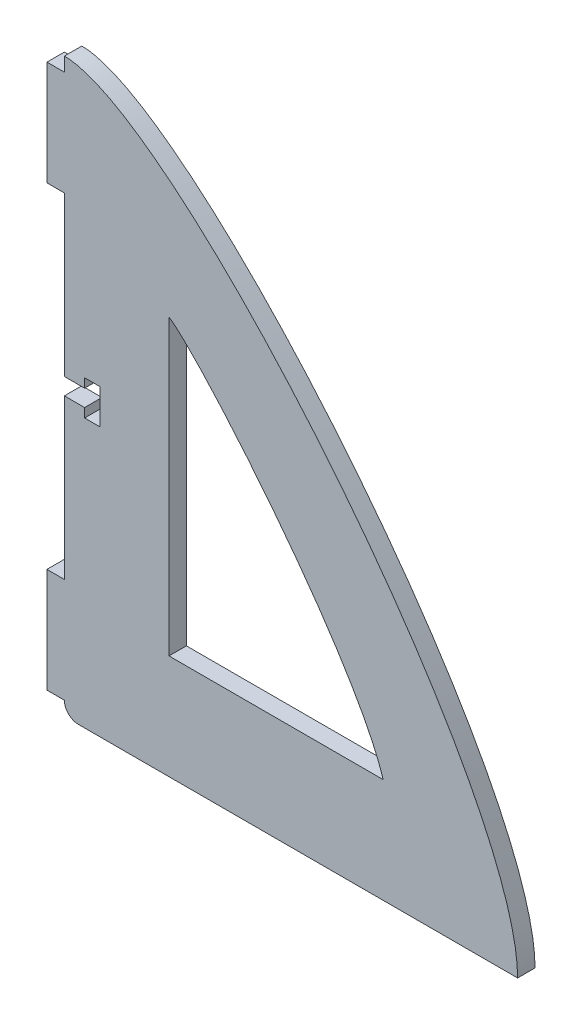
ISO-10303-21;
HEADER;
FILE_DESCRIPTION(('STEP AP214'),'2;1');
FILE_NAME('part.step','',(''),(''),'','','');
FILE_SCHEMA(('AUTOMOTIVE_DESIGN { 1 0 10303 214 1 1 1 1 }'));
ENDSEC;
DATA;
#1=APPLICATION_CONTEXT('core data for automotive mechanical design processes');
#2=APPLICATION_PROTOCOL_DEFINITION('international standard','automotive_design',2000,#1);
#3=PRODUCT_CONTEXT('',#1,'mechanical');
#4=PRODUCT('Part','Part','',(#3));
#5=PRODUCT_RELATED_PRODUCT_CATEGORY('part','',(#4));
#6=PRODUCT_DEFINITION_FORMATION('','',#4);
#7=PRODUCT_DEFINITION_CONTEXT('part definition',#1,'design');
#8=PRODUCT_DEFINITION('design','',#6,#7);
#9=PRODUCT_DEFINITION_SHAPE('','',#8);
#10=(LENGTH_UNIT() NAMED_UNIT(*) SI_UNIT(.MILLI.,.METRE.));
#11=(NAMED_UNIT(*) PLANE_ANGLE_UNIT() SI_UNIT($,.RADIAN.));
#12=(NAMED_UNIT(*) SI_UNIT($,.STERADIAN.) SOLID_ANGLE_UNIT());
#13=UNCERTAINTY_MEASURE_WITH_UNIT(LENGTH_MEASURE(1.E-05),#10,'distance_accuracy_value','');
#14=(GEOMETRIC_REPRESENTATION_CONTEXT(3) GLOBAL_UNCERTAINTY_ASSIGNED_CONTEXT((#13)) GLOBAL_UNIT_ASSIGNED_CONTEXT((#10,
#11,#12)) REPRESENTATION_CONTEXT('',''));
#15=CARTESIAN_POINT('',(0.,0.,0.));
#16=DIRECTION('',(0.,0.,1.));
#17=DIRECTION('',(1.,0.,0.));
#18=AXIS2_PLACEMENT_3D('',#15,#16,#17);
#19=CARTESIAN_POINT('',(49.08086934543,63.1550222466123,3.175));
#20=DIRECTION('',(0.,0.,1.));
#21=DIRECTION('',(1.,0.,0.));
#22=AXIS2_PLACEMENT_3D('',#19,#20,#21);
#23=PLANE('',#22);
#24=CARTESIAN_POINT('',(82.55,0.,3.175));
#25=CARTESIAN_POINT('',(82.55,29.5600593242995,3.175));
#26=CARTESIAN_POINT('',(20.8156515878134,104.14,3.175));
#27=CARTESIAN_POINT('',(0.,104.14,3.175));
#28=B_SPLINE_CURVE_WITH_KNOTS('',3,(#24,#25,#26,#27),.UNSPECIFIED.,.F.,.F.,(4,4),(0.,1.),.UNSPECIFIED.);
#29=CARTESIAN_POINT('',(82.55,0.,3.175));
#30=VERTEX_POINT('',#29);
#31=CARTESIAN_POINT('',(0.,104.14,3.175));
#32=VERTEX_POINT('',#31);
#33=EDGE_CURVE('E219',#30,#32,#28,.T.);
#34=ORIENTED_EDGE('',*,*,#33,.T.);
#35=DIRECTION('',(0.,-1.,0.));
#36=VECTOR('',#35,1.);
#37=CARTESIAN_POINT('',(0.,101.6,3.175));
#38=LINE('',#37,#36);
#39=CARTESIAN_POINT('',(0.,101.6,3.175));
#40=VERTEX_POINT('',#39);
#41=EDGE_CURVE('E225',#32,#40,#38,.T.);
#42=ORIENTED_EDGE('',*,*,#41,.T.);
#43=DIRECTION('',(-1.,0.,0.));
#44=VECTOR('',#43,1.);
#45=CARTESIAN_POINT('',(0.,101.6,3.175));
#46=LINE('',#45,#44);
#47=CARTESIAN_POINT('',(-3.17499999999999,101.6,3.175));
#48=VERTEX_POINT('',#47);
#49=EDGE_CURVE('E231',#40,#48,#46,.T.);
#50=ORIENTED_EDGE('',*,*,#49,.T.);
#51=DIRECTION('',(0.,-1.,0.));
#52=VECTOR('',#51,1.);
#53=CARTESIAN_POINT('',(-3.17499999999999,101.6,3.175));
#54=LINE('',#53,#52);
#55=CARTESIAN_POINT('',(-3.17499999999999,82.55,3.175));
#56=VERTEX_POINT('',#55);
#57=EDGE_CURVE('E233',#48,#56,#54,.T.);
#58=ORIENTED_EDGE('',*,*,#57,.T.);
#59=DIRECTION('',(1.,0.,0.));
#60=VECTOR('',#59,1.);
#61=CARTESIAN_POINT('',(-3.17499999999999,82.55,3.175));
#62=LINE('',#61,#60);
#63=CARTESIAN_POINT('',(0.,82.55,3.175));
#64=VERTEX_POINT('',#63);
#65=EDGE_CURVE('E235',#56,#64,#62,.T.);
#66=ORIENTED_EDGE('',*,*,#65,.T.);
#67=DIRECTION('',(0.,-1.,0.));
#68=VECTOR('',#67,1.);
#69=CARTESIAN_POINT('',(0.,82.55,3.175));
#70=LINE('',#69,#68);
#71=CARTESIAN_POINT('',(0.,53.594,3.175));
#72=VERTEX_POINT('',#71);
#73=EDGE_CURVE('E237',#64,#72,#70,.T.);
#74=ORIENTED_EDGE('',*,*,#73,.T.);
#75=DIRECTION('',(1.,0.,0.));
#76=VECTOR('',#75,1.);
#77=CARTESIAN_POINT('',(0.,53.594,3.175));
#78=LINE('',#77,#76);
#79=CARTESIAN_POINT('',(3.68300000000001,53.594,3.175));
#80=VERTEX_POINT('',#79);
#81=EDGE_CURVE('E239',#72,#80,#78,.T.);
#82=ORIENTED_EDGE('',*,*,#81,.T.);
#83=DIRECTION('',(0.,1.,0.));
#84=VECTOR('',#83,1.);
#85=CARTESIAN_POINT('',(3.68300000000001,53.594,3.175));
#86=LINE('',#85,#84);
#87=CARTESIAN_POINT('',(3.68300000000001,55.245,3.175));
#88=VERTEX_POINT('',#87);
#89=EDGE_CURVE('E241',#80,#88,#86,.T.);
#90=ORIENTED_EDGE('',*,*,#89,.T.);
#91=DIRECTION('',(1.,0.,0.));
#92=VECTOR('',#91,1.);
#93=CARTESIAN_POINT('',(3.68300000000001,55.245,3.175));
#94=LINE('',#93,#92);
#95=CARTESIAN_POINT('',(6.47700000000001,55.245,3.175));
#96=VERTEX_POINT('',#95);
#97=EDGE_CURVE('E243',#88,#96,#94,.T.);
#98=ORIENTED_EDGE('',*,*,#97,.T.);
#99=DIRECTION('',(0.,-1.,0.));
#100=VECTOR('',#99,1.);
#101=CARTESIAN_POINT('',(6.47700000000001,55.245,3.175));
#102=LINE('',#101,#100);
#103=CARTESIAN_POINT('',(6.47700000000001,48.895,3.175));
#104=VERTEX_POINT('',#103);
#105=EDGE_CURVE('E245',#96,#104,#102,.T.);
#106=ORIENTED_EDGE('',*,*,#105,.T.);
#107=DIRECTION('',(-1.,0.,0.));
#108=VECTOR('',#107,1.);
#109=CARTESIAN_POINT('',(6.47700000000001,48.895,3.175));
#110=LINE('',#109,#108);
#111=CARTESIAN_POINT('',(3.68300000000001,48.895,3.175));
#112=VERTEX_POINT('',#111);
#113=EDGE_CURVE('E247',#104,#112,#110,.T.);
#114=ORIENTED_EDGE('',*,*,#113,.T.);
#115=DIRECTION('',(0.,1.,0.));
#116=VECTOR('',#115,1.);
#117=CARTESIAN_POINT('',(3.68300000000001,48.895,3.175));
#118=LINE('',#117,#116);
#119=CARTESIAN_POINT('',(3.68300000000001,50.546,3.175));
#120=VERTEX_POINT('',#119);
#121=EDGE_CURVE('E249',#112,#120,#118,.T.);
#122=ORIENTED_EDGE('',*,*,#121,.T.);
#123=DIRECTION('',(-1.,0.,0.));
#124=VECTOR('',#123,1.);
#125=CARTESIAN_POINT('',(3.68300000000001,50.546,3.175));
#126=LINE('',#125,#124);
#127=CARTESIAN_POINT('',(0.,50.546,3.175));
#128=VERTEX_POINT('',#127);
#129=EDGE_CURVE('E251',#120,#128,#126,.T.);
#130=ORIENTED_EDGE('',*,*,#129,.T.);
#131=DIRECTION('',(0.,-1.,0.));
#132=VECTOR('',#131,1.);
#133=CARTESIAN_POINT('',(0.,50.546,3.175));
#134=LINE('',#133,#132);
#135=CARTESIAN_POINT('',(0.,21.59,3.175));
#136=VERTEX_POINT('',#135);
#137=EDGE_CURVE('E253',#128,#136,#134,.T.);
#138=ORIENTED_EDGE('',*,*,#137,.T.);
#139=DIRECTION('',(-1.,0.,0.));
#140=VECTOR('',#139,1.);
#141=CARTESIAN_POINT('',(-3.175,21.59,3.175));
#142=LINE('',#141,#140);
#143=CARTESIAN_POINT('',(-3.175,21.59,3.175));
#144=VERTEX_POINT('',#143);
#145=EDGE_CURVE('E255',#136,#144,#142,.T.);
#146=ORIENTED_EDGE('',*,*,#145,.T.);
#147=DIRECTION('',(0.,-1.,0.));
#148=VECTOR('',#147,1.);
#149=CARTESIAN_POINT('',(-3.175,2.54,3.175));
#150=LINE('',#149,#148);
#151=CARTESIAN_POINT('',(-3.175,2.54,3.175));
#152=VERTEX_POINT('',#151);
#153=EDGE_CURVE('E257',#144,#152,#150,.T.);
#154=ORIENTED_EDGE('',*,*,#153,.T.);
#155=DIRECTION('',(1.,0.,0.));
#156=VECTOR('',#155,1.);
#157=CARTESIAN_POINT('',(0.,2.54,3.175));
#158=LINE('',#157,#156);
#159=CARTESIAN_POINT('',(0.,2.54,3.175));
#160=VERTEX_POINT('',#159);
#161=EDGE_CURVE('E259',#152,#160,#158,.T.);
#162=ORIENTED_EDGE('',*,*,#161,.T.);
#163=CARTESIAN_POINT('',(2.54000000000001,2.54,3.175));
#164=DIRECTION('',(0.,0.,1.));
#165=DIRECTION('',(1.,0.,0.));
#166=AXIS2_PLACEMENT_3D('',#163,#164,#165);
#167=CIRCLE('',#166,2.54);
#168=CARTESIAN_POINT('',(2.54000000000001,0.,3.175));
#169=VERTEX_POINT('',#168);
#170=EDGE_CURVE('E261',#160,#169,#167,.T.);
#171=ORIENTED_EDGE('',*,*,#170,.T.);
#172=DIRECTION('',(1.,0.,0.));
#173=VECTOR('',#172,1.);
#174=CARTESIAN_POINT('',(2.54000000000001,0.,3.175));
#175=LINE('',#174,#173);
#176=EDGE_CURVE('E263',#169,#30,#175,.T.);
#177=ORIENTED_EDGE('',*,*,#176,.T.);
#178=EDGE_LOOP('',(#34,#42,#50,#58,#66,#74,#82,#90,#98,#106,#114,#122,#130,#138,#146,#154,#162,
#171,#177));
#179=FACE_BOUND('',#178,.T.);
#180=DIRECTION('',(0.,-1.,0.));
#181=VECTOR('',#180,1.);
#182=CARTESIAN_POINT('',(19.05,72.5277006282425,3.175));
#183=LINE('',#182,#181);
#184=CARTESIAN_POINT('',(19.05,72.5277006282425,3.175));
#185=VERTEX_POINT('',#184);
#186=CARTESIAN_POINT('',(19.05,19.05,3.175));
#187=VERTEX_POINT('',#186);
#188=EDGE_CURVE('E193',#185,#187,#183,.T.);
#189=ORIENTED_EDGE('',*,*,#188,.F.);
#190=CARTESIAN_POINT('',(58.0732755997919,19.05,3.175));
#191=CARTESIAN_POINT('',(52.9819705020623,35.4593054658,3.175));
#192=CARTESIAN_POINT('',(24.9796059291707,68.6375608936451,3.175));
#193=CARTESIAN_POINT('',(19.05,72.5277006282425,3.175));
#194=B_SPLINE_CURVE_WITH_KNOTS('',3,(#190,#191,#192,#193),.UNSPECIFIED.,.F.,.F.,(4,4),(0.,1.),.UNSPECIFIED.);
#195=CARTESIAN_POINT('',(58.0732755997919,19.05,3.175));
#196=VERTEX_POINT('',#195);
#197=EDGE_CURVE('E185',#196,#185,#194,.T.);
#198=ORIENTED_EDGE('',*,*,#197,.F.);
#199=DIRECTION('',(1.,0.,0.));
#200=VECTOR('',#199,1.);
#201=CARTESIAN_POINT('',(19.05,19.05,3.175));
#202=LINE('',#201,#200);
#203=EDGE_CURVE('E202',#187,#196,#202,.T.);
#204=ORIENTED_EDGE('',*,*,#203,.F.);
#205=EDGE_LOOP('',(#189,#198,#204));
#206=FACE_BOUND('',#205,.T.);
#207=ADVANCED_FACE('F35',(#179,#206),#23,.T.);
#208=CARTESIAN_POINT('',(49.08086934543,63.1550222466123,0.));
#209=DIRECTION('',(0.,0.,1.));
#210=DIRECTION('',(1.,0.,0.));
#211=AXIS2_PLACEMENT_3D('',#208,#209,#210);
#212=PLANE('',#211);
#213=CARTESIAN_POINT('',(82.55,0.,0.));
#214=CARTESIAN_POINT('',(82.55,29.5600593242995,0.));
#215=CARTESIAN_POINT('',(20.8156515878134,104.14,0.));
#216=CARTESIAN_POINT('',(0.,104.14,0.));
#217=B_SPLINE_CURVE_WITH_KNOTS('',3,(#213,#214,#215,#216),.UNSPECIFIED.,.F.,.F.,(4,4),(0.,1.),.UNSPECIFIED.);
#218=CARTESIAN_POINT('',(82.55,0.,0.));
#219=VERTEX_POINT('',#218);
#220=CARTESIAN_POINT('',(0.,104.14,0.));
#221=VERTEX_POINT('',#220);
#222=EDGE_CURVE('E200',#219,#221,#217,.T.);
#223=ORIENTED_EDGE('',*,*,#222,.F.);
#224=DIRECTION('',(1.,0.,0.));
#225=VECTOR('',#224,1.);
#226=CARTESIAN_POINT('',(2.54000000000001,0.,0.));
#227=LINE('',#226,#225);
#228=CARTESIAN_POINT('',(2.54000000000001,0.,0.));
#229=VERTEX_POINT('',#228);
#230=EDGE_CURVE('E226',#229,#219,#227,.T.);
#231=ORIENTED_EDGE('',*,*,#230,.F.);
#232=CARTESIAN_POINT('',(2.54000000000001,2.54,0.));
#233=DIRECTION('',(0.,0.,1.));
#234=DIRECTION('',(1.,0.,0.));
#235=AXIS2_PLACEMENT_3D('',#232,#233,#234);
#236=CIRCLE('',#235,2.54);
#237=CARTESIAN_POINT('',(0.,2.54,0.));
#238=VERTEX_POINT('',#237);
#239=EDGE_CURVE('E305',#238,#229,#236,.T.);
#240=ORIENTED_EDGE('',*,*,#239,.F.);
#241=DIRECTION('',(1.,0.,0.));
#242=VECTOR('',#241,1.);
#243=CARTESIAN_POINT('',(0.,2.54,0.));
#244=LINE('',#243,#242);
#245=CARTESIAN_POINT('',(-3.175,2.54,0.));
#246=VERTEX_POINT('',#245);
#247=EDGE_CURVE('E303',#246,#238,#244,.T.);
#248=ORIENTED_EDGE('',*,*,#247,.F.);
#249=DIRECTION('',(0.,-1.,0.));
#250=VECTOR('',#249,1.);
#251=CARTESIAN_POINT('',(-3.175,2.54,0.));
#252=LINE('',#251,#250);
#253=CARTESIAN_POINT('',(-3.175,21.59,0.));
#254=VERTEX_POINT('',#253);
#255=EDGE_CURVE('E301',#254,#246,#252,.T.);
#256=ORIENTED_EDGE('',*,*,#255,.F.);
#257=DIRECTION('',(-1.,0.,0.));
#258=VECTOR('',#257,1.);
#259=CARTESIAN_POINT('',(-3.175,21.59,0.));
#260=LINE('',#259,#258);
#261=CARTESIAN_POINT('',(0.,21.59,0.));
#262=VERTEX_POINT('',#261);
#263=EDGE_CURVE('E299',#262,#254,#260,.T.);
#264=ORIENTED_EDGE('',*,*,#263,.F.);
#265=DIRECTION('',(0.,-1.,0.));
#266=VECTOR('',#265,1.);
#267=CARTESIAN_POINT('',(0.,50.546,0.));
#268=LINE('',#267,#266);
#269=CARTESIAN_POINT('',(0.,50.546,0.));
#270=VERTEX_POINT('',#269);
#271=EDGE_CURVE('E297',#270,#262,#268,.T.);
#272=ORIENTED_EDGE('',*,*,#271,.F.);
#273=DIRECTION('',(-1.,0.,0.));
#274=VECTOR('',#273,1.);
#275=CARTESIAN_POINT('',(3.68300000000001,50.546,0.));
#276=LINE('',#275,#274);
#277=CARTESIAN_POINT('',(3.68300000000001,50.546,0.));
#278=VERTEX_POINT('',#277);
#279=EDGE_CURVE('E295',#278,#270,#276,.T.);
#280=ORIENTED_EDGE('',*,*,#279,.F.);
#281=DIRECTION('',(0.,1.,0.));
#282=VECTOR('',#281,1.);
#283=CARTESIAN_POINT('',(3.68300000000001,48.895,0.));
#284=LINE('',#283,#282);
#285=CARTESIAN_POINT('',(3.68300000000001,48.895,0.));
#286=VERTEX_POINT('',#285);
#287=EDGE_CURVE('E293',#286,#278,#284,.T.);
#288=ORIENTED_EDGE('',*,*,#287,.F.);
#289=DIRECTION('',(-1.,0.,0.));
#290=VECTOR('',#289,1.);
#291=CARTESIAN_POINT('',(6.47700000000001,48.895,0.));
#292=LINE('',#291,#290);
#293=CARTESIAN_POINT('',(6.47700000000001,48.895,0.));
#294=VERTEX_POINT('',#293);
#295=EDGE_CURVE('E291',#294,#286,#292,.T.);
#296=ORIENTED_EDGE('',*,*,#295,.F.);
#297=DIRECTION('',(0.,-1.,0.));
#298=VECTOR('',#297,1.);
#299=CARTESIAN_POINT('',(6.47700000000001,55.245,0.));
#300=LINE('',#299,#298);
#301=CARTESIAN_POINT('',(6.47700000000001,55.245,0.));
#302=VERTEX_POINT('',#301);
#303=EDGE_CURVE('E289',#302,#294,#300,.T.);
#304=ORIENTED_EDGE('',*,*,#303,.F.);
#305=DIRECTION('',(1.,0.,0.));
#306=VECTOR('',#305,1.);
#307=CARTESIAN_POINT('',(3.68300000000001,55.245,0.));
#308=LINE('',#307,#306);
#309=CARTESIAN_POINT('',(3.68300000000001,55.245,0.));
#310=VERTEX_POINT('',#309);
#311=EDGE_CURVE('E287',#310,#302,#308,.T.);
#312=ORIENTED_EDGE('',*,*,#311,.F.);
#313=DIRECTION('',(0.,1.,0.));
#314=VECTOR('',#313,1.);
#315=CARTESIAN_POINT('',(3.68300000000001,53.594,0.));
#316=LINE('',#315,#314);
#317=CARTESIAN_POINT('',(3.68300000000001,53.594,0.));
#318=VERTEX_POINT('',#317);
#319=EDGE_CURVE('E285',#318,#310,#316,.T.);
#320=ORIENTED_EDGE('',*,*,#319,.F.);
#321=DIRECTION('',(1.,0.,0.));
#322=VECTOR('',#321,1.);
#323=CARTESIAN_POINT('',(0.,53.594,0.));
#324=LINE('',#323,#322);
#325=CARTESIAN_POINT('',(0.,53.594,0.));
#326=VERTEX_POINT('',#325);
#327=EDGE_CURVE('E283',#326,#318,#324,.T.);
#328=ORIENTED_EDGE('',*,*,#327,.F.);
#329=DIRECTION('',(0.,-1.,0.));
#330=VECTOR('',#329,1.);
#331=CARTESIAN_POINT('',(0.,82.55,0.));
#332=LINE('',#331,#330);
#333=CARTESIAN_POINT('',(0.,82.55,0.));
#334=VERTEX_POINT('',#333);
#335=EDGE_CURVE('E281',#334,#326,#332,.T.);
#336=ORIENTED_EDGE('',*,*,#335,.F.);
#337=DIRECTION('',(1.,0.,0.));
#338=VECTOR('',#337,1.);
#339=CARTESIAN_POINT('',(-3.17499999999999,82.55,0.));
#340=LINE('',#339,#338);
#341=CARTESIAN_POINT('',(-3.17499999999999,82.55,0.));
#342=VERTEX_POINT('',#341);
#343=EDGE_CURVE('E279',#342,#334,#340,.T.);
#344=ORIENTED_EDGE('',*,*,#343,.F.);
#345=DIRECTION('',(0.,-1.,0.));
#346=VECTOR('',#345,1.);
#347=CARTESIAN_POINT('',(-3.17499999999999,101.6,0.));
#348=LINE('',#347,#346);
#349=CARTESIAN_POINT('',(-3.17499999999999,101.6,0.));
#350=VERTEX_POINT('',#349);
#351=EDGE_CURVE('E277',#350,#342,#348,.T.);
#352=ORIENTED_EDGE('',*,*,#351,.F.);
#353=DIRECTION('',(-1.,0.,0.));
#354=VECTOR('',#353,1.);
#355=CARTESIAN_POINT('',(0.,101.6,0.));
#356=LINE('',#355,#354);
#357=CARTESIAN_POINT('',(0.,101.6,0.));
#358=VERTEX_POINT('',#357);
#359=EDGE_CURVE('E275',#358,#350,#356,.T.);
#360=ORIENTED_EDGE('',*,*,#359,.F.);
#361=DIRECTION('',(0.,-1.,0.));
#362=VECTOR('',#361,1.);
#363=CARTESIAN_POINT('',(0.,101.6,0.));
#364=LINE('',#363,#362);
#365=EDGE_CURVE('E270',#221,#358,#364,.T.);
#366=ORIENTED_EDGE('',*,*,#365,.F.);
#367=EDGE_LOOP('',(#223,#231,#240,#248,#256,#264,#272,#280,#288,#296,#304,#312,#320,#328,#336,
#344,#352,#360,#366));
#368=FACE_BOUND('',#367,.T.);
#369=CARTESIAN_POINT('',(58.0732755997919,19.05,0.));
#370=CARTESIAN_POINT('',(52.9819705020623,35.4593054658,0.));
#371=CARTESIAN_POINT('',(24.9796059291707,68.6375608936451,0.));
#372=CARTESIAN_POINT('',(19.05,72.5277006282425,0.));
#373=B_SPLINE_CURVE_WITH_KNOTS('',3,(#369,#370,#371,#372),.UNSPECIFIED.,.F.,.F.,(4,4),(0.,1.),.UNSPECIFIED.);
#374=CARTESIAN_POINT('',(58.0732755997919,19.05,0.));
#375=VERTEX_POINT('',#374);
#376=CARTESIAN_POINT('',(19.05,72.5277006282425,0.));
#377=VERTEX_POINT('',#376);
#378=EDGE_CURVE('E59',#375,#377,#373,.T.);
#379=ORIENTED_EDGE('',*,*,#378,.T.);
#380=DIRECTION('',(0.,-1.,0.));
#381=VECTOR('',#380,1.);
#382=CARTESIAN_POINT('',(19.05,72.5277006282425,0.));
#383=LINE('',#382,#381);
#384=CARTESIAN_POINT('',(19.05,19.05,0.));
#385=VERTEX_POINT('',#384);
#386=EDGE_CURVE('E199',#377,#385,#383,.T.);
#387=ORIENTED_EDGE('',*,*,#386,.T.);
#388=DIRECTION('',(1.,0.,0.));
#389=VECTOR('',#388,1.);
#390=CARTESIAN_POINT('',(19.05,19.05,0.));
#391=LINE('',#390,#389);
#392=EDGE_CURVE('E194',#385,#375,#391,.T.);
#393=ORIENTED_EDGE('',*,*,#392,.T.);
#394=EDGE_LOOP('',(#379,#387,#393));
#395=FACE_BOUND('',#394,.T.);
#396=ADVANCED_FACE('F368',(#368,#395),#212,.F.);
#397=DIRECTION('',(0.,0.,-1.));
#398=VECTOR('',#397,1.);
#399=SURFACE_OF_LINEAR_EXTRUSION('',#28,#398);
#400=ORIENTED_EDGE('',*,*,#222,.T.);
#401=DIRECTION('',(0.,0.,-1.));
#402=VECTOR('',#401,1.);
#403=CARTESIAN_POINT('',(0.,104.14,3.175));
#404=LINE('',#403,#402);
#405=EDGE_CURVE('E11',#32,#221,#404,.T.);
#406=ORIENTED_EDGE('',*,*,#405,.F.);
#407=ORIENTED_EDGE('',*,*,#33,.F.);
#408=DIRECTION('',(0.,0.,-1.));
#409=VECTOR('',#408,1.);
#410=CARTESIAN_POINT('',(82.55,0.,3.175));
#411=LINE('',#410,#409);
#412=EDGE_CURVE('E265',#30,#219,#411,.T.);
#413=ORIENTED_EDGE('',*,*,#412,.T.);
#414=EDGE_LOOP('',(#400,#406,#407,#413));
#415=FACE_BOUND('',#414,.T.);
#416=ADVANCED_FACE('F37',(#415),#399,.F.);
#417=CARTESIAN_POINT('',(0.,101.6,3.175));
#418=DIRECTION('',(1.,0.,0.));
#419=DIRECTION('',(0.,1.,0.));
#420=AXIS2_PLACEMENT_3D('',#417,#418,#419);
#421=PLANE('',#420);
#422=ORIENTED_EDGE('',*,*,#365,.T.);
#423=DIRECTION('',(0.,0.,-1.));
#424=VECTOR('',#423,1.);
#425=CARTESIAN_POINT('',(0.,101.6,3.175));
#426=LINE('',#425,#424);
#427=EDGE_CURVE('E44',#40,#358,#426,.T.);
#428=ORIENTED_EDGE('',*,*,#427,.F.);
#429=ORIENTED_EDGE('',*,*,#41,.F.);
#430=ORIENTED_EDGE('',*,*,#405,.T.);
#431=EDGE_LOOP('',(#422,#428,#429,#430));
#432=FACE_BOUND('',#431,.T.);
#433=ADVANCED_FACE('F385',(#432),#421,.F.);
#434=CARTESIAN_POINT('',(0.,101.6,3.175));
#435=DIRECTION('',(0.,-1.,0.));
#436=DIRECTION('',(1.,0.,0.));
#437=AXIS2_PLACEMENT_3D('',#434,#435,#436);
#438=PLANE('',#437);
#439=ORIENTED_EDGE('',*,*,#359,.T.);
#440=DIRECTION('',(0.,0.,-1.));
#441=VECTOR('',#440,1.);
#442=CARTESIAN_POINT('',(-3.17499999999999,101.6,3.175));
#443=LINE('',#442,#441);
#444=EDGE_CURVE('E355',#48,#350,#443,.T.);
#445=ORIENTED_EDGE('',*,*,#444,.F.);
#446=ORIENTED_EDGE('',*,*,#49,.F.);
#447=ORIENTED_EDGE('',*,*,#427,.T.);
#448=EDGE_LOOP('',(#439,#445,#446,#447));
#449=FACE_BOUND('',#448,.T.);
#450=ADVANCED_FACE('F362',(#449),#438,.F.);
#451=CARTESIAN_POINT('',(-3.17499999999999,101.6,3.175));
#452=DIRECTION('',(1.,0.,0.));
#453=DIRECTION('',(0.,1.,0.));
#454=AXIS2_PLACEMENT_3D('',#451,#452,#453);
#455=PLANE('',#454);
#456=ORIENTED_EDGE('',*,*,#351,.T.);
#457=DIRECTION('',(0.,0.,-1.));
#458=VECTOR('',#457,1.);
#459=CARTESIAN_POINT('',(-3.17499999999999,82.55,3.175));
#460=LINE('',#459,#458);
#461=EDGE_CURVE('E352',#56,#342,#460,.T.);
#462=ORIENTED_EDGE('',*,*,#461,.F.);
#463=ORIENTED_EDGE('',*,*,#57,.F.);
#464=ORIENTED_EDGE('',*,*,#444,.T.);
#465=EDGE_LOOP('',(#456,#462,#463,#464));
#466=FACE_BOUND('',#465,.T.);
#467=ADVANCED_FACE('F374',(#466),#455,.F.);
#468=CARTESIAN_POINT('',(-3.17499999999999,82.55,3.175));
#469=DIRECTION('',(0.,1.,0.));
#470=DIRECTION('',(0.,0.,1.));
#471=AXIS2_PLACEMENT_3D('',#468,#469,#470);
#472=PLANE('',#471);
#473=ORIENTED_EDGE('',*,*,#343,.T.);
#474=DIRECTION('',(0.,0.,-1.));
#475=VECTOR('',#474,1.);
#476=CARTESIAN_POINT('',(0.,82.55,3.175));
#477=LINE('',#476,#475);
#478=EDGE_CURVE('E349',#64,#334,#477,.T.);
#479=ORIENTED_EDGE('',*,*,#478,.F.);
#480=ORIENTED_EDGE('',*,*,#65,.F.);
#481=ORIENTED_EDGE('',*,*,#461,.T.);
#482=EDGE_LOOP('',(#473,#479,#480,#481));
#483=FACE_BOUND('',#482,.T.);
#484=ADVANCED_FACE('F378',(#483),#472,.F.);
#485=CARTESIAN_POINT('',(0.,82.55,3.175));
#486=DIRECTION('',(1.,0.,0.));
#487=DIRECTION('',(0.,1.,0.));
#488=AXIS2_PLACEMENT_3D('',#485,#486,#487);
#489=PLANE('',#488);
#490=ORIENTED_EDGE('',*,*,#335,.T.);
#491=DIRECTION('',(0.,0.,-1.));
#492=VECTOR('',#491,1.);
#493=CARTESIAN_POINT('',(0.,53.594,3.175));
#494=LINE('',#493,#492);
#495=EDGE_CURVE('E346',#72,#326,#494,.T.);
#496=ORIENTED_EDGE('',*,*,#495,.F.);
#497=ORIENTED_EDGE('',*,*,#73,.F.);
#498=ORIENTED_EDGE('',*,*,#478,.T.);
#499=EDGE_LOOP('',(#490,#496,#497,#498));
#500=FACE_BOUND('',#499,.T.);
#501=ADVANCED_FACE('F453',(#500),#489,.F.);
#502=CARTESIAN_POINT('',(0.,53.594,3.175));
#503=DIRECTION('',(0.,1.,0.));
#504=DIRECTION('',(0.,0.,1.));
#505=AXIS2_PLACEMENT_3D('',#502,#503,#504);
#506=PLANE('',#505);
#507=ORIENTED_EDGE('',*,*,#327,.T.);
#508=DIRECTION('',(0.,0.,-1.));
#509=VECTOR('',#508,1.);
#510=CARTESIAN_POINT('',(3.68300000000001,53.594,3.175));
#511=LINE('',#510,#509);
#512=EDGE_CURVE('E343',#80,#318,#511,.T.);
#513=ORIENTED_EDGE('',*,*,#512,.F.);
#514=ORIENTED_EDGE('',*,*,#81,.F.);
#515=ORIENTED_EDGE('',*,*,#495,.T.);
#516=EDGE_LOOP('',(#507,#513,#514,#515));
#517=FACE_BOUND('',#516,.T.);
#518=ADVANCED_FACE('F450',(#517),#506,.F.);
#519=CARTESIAN_POINT('',(3.68300000000001,53.594,3.175));
#520=DIRECTION('',(-1.,0.,0.));
#521=DIRECTION('',(0.,-1.,0.));
#522=AXIS2_PLACEMENT_3D('',#519,#520,#521);
#523=PLANE('',#522);
#524=ORIENTED_EDGE('',*,*,#319,.T.);
#525=DIRECTION('',(0.,0.,-1.));
#526=VECTOR('',#525,1.);
#527=CARTESIAN_POINT('',(3.68300000000001,55.245,3.175));
#528=LINE('',#527,#526);
#529=EDGE_CURVE('E340',#88,#310,#528,.T.);
#530=ORIENTED_EDGE('',*,*,#529,.F.);
#531=ORIENTED_EDGE('',*,*,#89,.F.);
#532=ORIENTED_EDGE('',*,*,#512,.T.);
#533=EDGE_LOOP('',(#524,#530,#531,#532));
#534=FACE_BOUND('',#533,.T.);
#535=ADVANCED_FACE('F446',(#534),#523,.F.);
#536=CARTESIAN_POINT('',(3.68300000000001,55.245,3.175));
#537=DIRECTION('',(0.,1.,0.));
#538=DIRECTION('',(0.,0.,1.));
#539=AXIS2_PLACEMENT_3D('',#536,#537,#538);
#540=PLANE('',#539);
#541=ORIENTED_EDGE('',*,*,#311,.T.);
#542=DIRECTION('',(0.,0.,-1.));
#543=VECTOR('',#542,1.);
#544=CARTESIAN_POINT('',(6.47700000000001,55.245,3.175));
#545=LINE('',#544,#543);
#546=EDGE_CURVE('E337',#96,#302,#545,.T.);
#547=ORIENTED_EDGE('',*,*,#546,.F.);
#548=ORIENTED_EDGE('',*,*,#97,.F.);
#549=ORIENTED_EDGE('',*,*,#529,.T.);
#550=EDGE_LOOP('',(#541,#547,#548,#549));
#551=FACE_BOUND('',#550,.T.);
#552=ADVANCED_FACE('F442',(#551),#540,.F.);
#553=CARTESIAN_POINT('',(6.47700000000001,55.245,3.175));
#554=DIRECTION('',(1.,0.,0.));
#555=DIRECTION('',(0.,1.,0.));
#556=AXIS2_PLACEMENT_3D('',#553,#554,#555);
#557=PLANE('',#556);
#558=ORIENTED_EDGE('',*,*,#303,.T.);
#559=DIRECTION('',(0.,0.,-1.));
#560=VECTOR('',#559,1.);
#561=CARTESIAN_POINT('',(6.47700000000001,48.895,3.175));
#562=LINE('',#561,#560);
#563=EDGE_CURVE('E334',#104,#294,#562,.T.);
#564=ORIENTED_EDGE('',*,*,#563,.F.);
#565=ORIENTED_EDGE('',*,*,#105,.F.);
#566=ORIENTED_EDGE('',*,*,#546,.T.);
#567=EDGE_LOOP('',(#558,#564,#565,#566));
#568=FACE_BOUND('',#567,.T.);
#569=ADVANCED_FACE('F437',(#568),#557,.F.);
#570=CARTESIAN_POINT('',(6.47700000000001,48.895,3.175));
#571=DIRECTION('',(0.,-1.,0.));
#572=DIRECTION('',(0.,0.,-1.));
#573=AXIS2_PLACEMENT_3D('',#570,#571,#572);
#574=PLANE('',#573);
#575=ORIENTED_EDGE('',*,*,#295,.T.);
#576=DIRECTION('',(0.,0.,-1.));
#577=VECTOR('',#576,1.);
#578=CARTESIAN_POINT('',(3.68300000000001,48.895,3.175));
#579=LINE('',#578,#577);
#580=EDGE_CURVE('E331',#112,#286,#579,.T.);
#581=ORIENTED_EDGE('',*,*,#580,.F.);
#582=ORIENTED_EDGE('',*,*,#113,.F.);
#583=ORIENTED_EDGE('',*,*,#563,.T.);
#584=EDGE_LOOP('',(#575,#581,#582,#583));
#585=FACE_BOUND('',#584,.T.);
#586=ADVANCED_FACE('F431',(#585),#574,.F.);
#587=CARTESIAN_POINT('',(3.68300000000001,48.895,3.175));
#588=DIRECTION('',(-1.,0.,0.));
#589=DIRECTION('',(0.,-1.,0.));
#590=AXIS2_PLACEMENT_3D('',#587,#588,#589);
#591=PLANE('',#590);
#592=ORIENTED_EDGE('',*,*,#287,.T.);
#593=DIRECTION('',(0.,0.,-1.));
#594=VECTOR('',#593,1.);
#595=CARTESIAN_POINT('',(3.68300000000001,50.546,3.175));
#596=LINE('',#595,#594);
#597=EDGE_CURVE('E328',#120,#278,#596,.T.);
#598=ORIENTED_EDGE('',*,*,#597,.F.);
#599=ORIENTED_EDGE('',*,*,#121,.F.);
#600=ORIENTED_EDGE('',*,*,#580,.T.);
#601=EDGE_LOOP('',(#592,#598,#599,#600));
#602=FACE_BOUND('',#601,.T.);
#603=ADVANCED_FACE('F427',(#602),#591,.F.);
#604=CARTESIAN_POINT('',(3.68300000000001,50.546,3.175));
#605=DIRECTION('',(0.,-1.,0.));
#606=DIRECTION('',(0.,0.,-1.));
#607=AXIS2_PLACEMENT_3D('',#604,#605,#606);
#608=PLANE('',#607);
#609=ORIENTED_EDGE('',*,*,#279,.T.);
#610=DIRECTION('',(0.,0.,-1.));
#611=VECTOR('',#610,1.);
#612=CARTESIAN_POINT('',(0.,50.546,3.175));
#613=LINE('',#612,#611);
#614=EDGE_CURVE('E325',#128,#270,#613,.T.);
#615=ORIENTED_EDGE('',*,*,#614,.F.);
#616=ORIENTED_EDGE('',*,*,#129,.F.);
#617=ORIENTED_EDGE('',*,*,#597,.T.);
#618=EDGE_LOOP('',(#609,#615,#616,#617));
#619=FACE_BOUND('',#618,.T.);
#620=ADVANCED_FACE('F422',(#619),#608,.F.);
#621=CARTESIAN_POINT('',(0.,50.546,3.175));
#622=DIRECTION('',(1.,0.,0.));
#623=DIRECTION('',(0.,1.,0.));
#624=AXIS2_PLACEMENT_3D('',#621,#622,#623);
#625=PLANE('',#624);
#626=ORIENTED_EDGE('',*,*,#271,.T.);
#627=DIRECTION('',(0.,0.,-1.));
#628=VECTOR('',#627,1.);
#629=CARTESIAN_POINT('',(0.,21.59,3.175));
#630=LINE('',#629,#628);
#631=EDGE_CURVE('E322',#136,#262,#630,.T.);
#632=ORIENTED_EDGE('',*,*,#631,.F.);
#633=ORIENTED_EDGE('',*,*,#137,.F.);
#634=ORIENTED_EDGE('',*,*,#614,.T.);
#635=EDGE_LOOP('',(#626,#632,#633,#634));
#636=FACE_BOUND('',#635,.T.);
#637=ADVANCED_FACE('F416',(#636),#625,.F.);
#638=CARTESIAN_POINT('',(-3.175,21.59,3.175));
#639=DIRECTION('',(0.,-1.,0.));
#640=DIRECTION('',(1.,0.,0.));
#641=AXIS2_PLACEMENT_3D('',#638,#639,#640);
#642=PLANE('',#641);
#643=ORIENTED_EDGE('',*,*,#263,.T.);
#644=DIRECTION('',(0.,0.,-1.));
#645=VECTOR('',#644,1.);
#646=CARTESIAN_POINT('',(-3.175,21.59,3.175));
#647=LINE('',#646,#645);
#648=EDGE_CURVE('E319',#144,#254,#647,.T.);
#649=ORIENTED_EDGE('',*,*,#648,.F.);
#650=ORIENTED_EDGE('',*,*,#145,.F.);
#651=ORIENTED_EDGE('',*,*,#631,.T.);
#652=EDGE_LOOP('',(#643,#649,#650,#651));
#653=FACE_BOUND('',#652,.T.);
#654=ADVANCED_FACE('F412',(#653),#642,.F.);
#655=CARTESIAN_POINT('',(-3.175,2.54,3.175));
#656=DIRECTION('',(1.,0.,0.));
#657=DIRECTION('',(0.,1.,0.));
#658=AXIS2_PLACEMENT_3D('',#655,#656,#657);
#659=PLANE('',#658);
#660=ORIENTED_EDGE('',*,*,#255,.T.);
#661=DIRECTION('',(0.,0.,-1.));
#662=VECTOR('',#661,1.);
#663=CARTESIAN_POINT('',(-3.175,2.54,3.175));
#664=LINE('',#663,#662);
#665=EDGE_CURVE('E316',#152,#246,#664,.T.);
#666=ORIENTED_EDGE('',*,*,#665,.F.);
#667=ORIENTED_EDGE('',*,*,#153,.F.);
#668=ORIENTED_EDGE('',*,*,#648,.T.);
#669=EDGE_LOOP('',(#660,#666,#667,#668));
#670=FACE_BOUND('',#669,.T.);
#671=ADVANCED_FACE('F407',(#670),#659,.F.);
#672=CARTESIAN_POINT('',(0.,2.54,3.175));
#673=DIRECTION('',(0.,1.,0.));
#674=DIRECTION('',(-1.,0.,0.));
#675=AXIS2_PLACEMENT_3D('',#672,#673,#674);
#676=PLANE('',#675);
#677=ORIENTED_EDGE('',*,*,#247,.T.);
#678=DIRECTION('',(0.,0.,-1.));
#679=VECTOR('',#678,1.);
#680=CARTESIAN_POINT('',(0.,2.54,3.175));
#681=LINE('',#680,#679);
#682=EDGE_CURVE('E313',#160,#238,#681,.T.);
#683=ORIENTED_EDGE('',*,*,#682,.F.);
#684=ORIENTED_EDGE('',*,*,#161,.F.);
#685=ORIENTED_EDGE('',*,*,#665,.T.);
#686=EDGE_LOOP('',(#677,#683,#684,#685));
#687=FACE_BOUND('',#686,.T.);
#688=ADVANCED_FACE('F401',(#687),#676,.F.);
#689=CARTESIAN_POINT('',(2.54000000000001,2.54,3.175));
#690=DIRECTION('',(0.,0.,-1.));
#691=DIRECTION('',(-1.,0.,0.));
#692=AXIS2_PLACEMENT_3D('',#689,#690,#691);
#693=CYLINDRICAL_SURFACE('',#692,2.54);
#694=ORIENTED_EDGE('',*,*,#239,.T.);
#695=DIRECTION('',(0.,0.,-1.));
#696=VECTOR('',#695,1.);
#697=CARTESIAN_POINT('',(2.54000000000001,0.,3.175));
#698=LINE('',#697,#696);
#699=EDGE_CURVE('E310',#169,#229,#698,.T.);
#700=ORIENTED_EDGE('',*,*,#699,.F.);
#701=ORIENTED_EDGE('',*,*,#170,.F.);
#702=ORIENTED_EDGE('',*,*,#682,.T.);
#703=EDGE_LOOP('',(#694,#700,#701,#702));
#704=FACE_BOUND('',#703,.T.);
#705=ADVANCED_FACE('F397',(#704),#693,.T.);
#706=CARTESIAN_POINT('',(2.54000000000001,0.,3.175));
#707=DIRECTION('',(0.,1.,0.));
#708=DIRECTION('',(0.,0.,1.));
#709=AXIS2_PLACEMENT_3D('',#706,#707,#708);
#710=PLANE('',#709);
#711=ORIENTED_EDGE('',*,*,#230,.T.);
#712=ORIENTED_EDGE('',*,*,#412,.F.);
#713=ORIENTED_EDGE('',*,*,#176,.F.);
#714=ORIENTED_EDGE('',*,*,#699,.T.);
#715=EDGE_LOOP('',(#711,#712,#713,#714));
#716=FACE_BOUND('',#715,.T.);
#717=ADVANCED_FACE('F392',(#716),#710,.F.);
#718=DIRECTION('',(0.,0.,-1.));
#719=VECTOR('',#718,1.);
#720=SURFACE_OF_LINEAR_EXTRUSION('',#194,#719);
#721=ORIENTED_EDGE('',*,*,#378,.F.);
#722=DIRECTION('',(0.,0.,-1.));
#723=VECTOR('',#722,1.);
#724=CARTESIAN_POINT('',(58.0732755997919,19.05,3.175));
#725=LINE('',#724,#723);
#726=EDGE_CURVE('E189',#196,#375,#725,.T.);
#727=ORIENTED_EDGE('',*,*,#726,.F.);
#728=ORIENTED_EDGE('',*,*,#197,.T.);
#729=DIRECTION('',(0.,0.,-1.));
#730=VECTOR('',#729,1.);
#731=CARTESIAN_POINT('',(19.05,72.5277006282425,3.175));
#732=LINE('',#731,#730);
#733=EDGE_CURVE('E188',#185,#377,#732,.T.);
#734=ORIENTED_EDGE('',*,*,#733,.T.);
#735=EDGE_LOOP('',(#721,#727,#728,#734));
#736=FACE_BOUND('',#735,.T.);
#737=ADVANCED_FACE('F187',(#736),#720,.T.);
#738=CARTESIAN_POINT('',(19.05,72.5277006282425,3.175));
#739=DIRECTION('',(1.,0.,0.));
#740=DIRECTION('',(0.,1.,0.));
#741=AXIS2_PLACEMENT_3D('',#738,#739,#740);
#742=PLANE('',#741);
#743=ORIENTED_EDGE('',*,*,#386,.F.);
#744=ORIENTED_EDGE('',*,*,#733,.F.);
#745=ORIENTED_EDGE('',*,*,#188,.T.);
#746=DIRECTION('',(0.,0.,-1.));
#747=VECTOR('',#746,1.);
#748=CARTESIAN_POINT('',(19.05,19.05,3.175));
#749=LINE('',#748,#747);
#750=EDGE_CURVE('E51',#187,#385,#749,.T.);
#751=ORIENTED_EDGE('',*,*,#750,.T.);
#752=EDGE_LOOP('',(#743,#744,#745,#751));
#753=FACE_BOUND('',#752,.T.);
#754=ADVANCED_FACE('F197',(#753),#742,.T.);
#755=CARTESIAN_POINT('',(19.05,19.05,3.175));
#756=DIRECTION('',(0.,1.,0.));
#757=DIRECTION('',(-1.,0.,0.));
#758=AXIS2_PLACEMENT_3D('',#755,#756,#757);
#759=PLANE('',#758);
#760=ORIENTED_EDGE('',*,*,#392,.F.);
#761=ORIENTED_EDGE('',*,*,#750,.F.);
#762=ORIENTED_EDGE('',*,*,#203,.T.);
#763=ORIENTED_EDGE('',*,*,#726,.T.);
#764=EDGE_LOOP('',(#760,#761,#762,#763));
#765=FACE_BOUND('',#764,.T.);
#766=ADVANCED_FACE('F553',(#765),#759,.T.);
#767=CLOSED_SHELL('',(#207,#396,#416,#433,#450,#467,#484,#501,#518,#535,#552,#569,#586,#603,
#620,#637,#654,#671,#688,#705,#717,#737,#754,#766));
#768=MANIFOLD_SOLID_BREP('B2',#767);
#769=ADVANCED_BREP_SHAPE_REPRESENTATION('',(#18,#768),#14);
#770=SHAPE_DEFINITION_REPRESENTATION(#9,#769);
ENDSEC;
END-ISO-10303-21;
